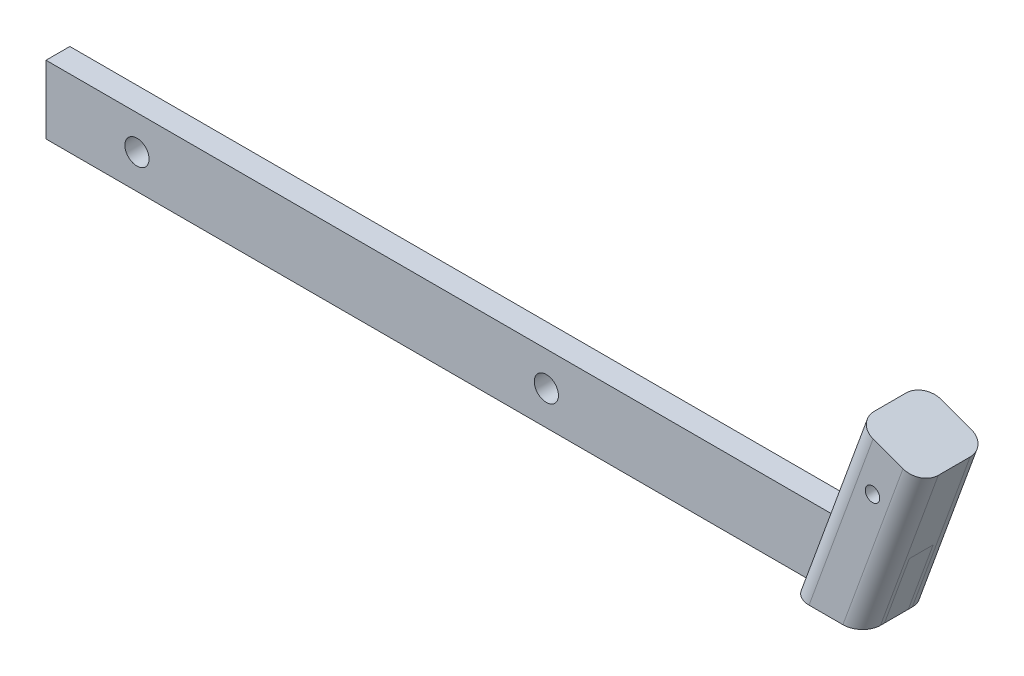
ISO-10303-21;
HEADER;
FILE_DESCRIPTION(('STEP AP214'),'2;1');
FILE_NAME('part.step','',(''),(''),'','','');
FILE_SCHEMA(('AUTOMOTIVE_DESIGN { 1 0 10303 214 1 1 1 1 }'));
ENDSEC;
DATA;
#1=APPLICATION_CONTEXT('core data for automotive mechanical design processes');
#2=APPLICATION_PROTOCOL_DEFINITION('international standard','automotive_design',2000,#1);
#3=PRODUCT_CONTEXT('',#1,'mechanical');
#4=PRODUCT('Part','Part','',(#3));
#5=PRODUCT_RELATED_PRODUCT_CATEGORY('part','',(#4));
#6=PRODUCT_DEFINITION_FORMATION('','',#4);
#7=PRODUCT_DEFINITION_CONTEXT('part definition',#1,'design');
#8=PRODUCT_DEFINITION('design','',#6,#7);
#9=PRODUCT_DEFINITION_SHAPE('','',#8);
#10=(LENGTH_UNIT() NAMED_UNIT(*) SI_UNIT(.MILLI.,.METRE.));
#11=(NAMED_UNIT(*) PLANE_ANGLE_UNIT() SI_UNIT($,.RADIAN.));
#12=(NAMED_UNIT(*) SI_UNIT($,.STERADIAN.) SOLID_ANGLE_UNIT());
#13=UNCERTAINTY_MEASURE_WITH_UNIT(LENGTH_MEASURE(1.E-05),#10,'distance_accuracy_value','');
#14=(GEOMETRIC_REPRESENTATION_CONTEXT(3) GLOBAL_UNCERTAINTY_ASSIGNED_CONTEXT((#13)) GLOBAL_UNIT_ASSIGNED_CONTEXT((#10,
#11,#12)) REPRESENTATION_CONTEXT('',''));
#15=CARTESIAN_POINT('',(0.,0.,0.));
#16=DIRECTION('',(0.,0.,1.));
#17=DIRECTION('',(1.,0.,0.));
#18=AXIS2_PLACEMENT_3D('',#15,#16,#17);
#19=CARTESIAN_POINT('',(-0.55938940169234,-29.386146661385,-9.525));
#20=DIRECTION('',(0.939692620785907,-0.342020143325672,0.));
#21=DIRECTION('',(0.342020143325672,0.939692620785907,0.));
#22=AXIS2_PLACEMENT_3D('',#19,#20,#21);
#23=PLANE('',#22);
#24=DIRECTION('',(-0.342020143325672,-0.939692620785907,0.));
#25=VECTOR('',#24,1.);
#26=CARTESIAN_POINT('',(12.9780644997125,7.80770224963224,-3.32740000000001));
#27=LINE('',#26,#25);
#28=CARTESIAN_POINT('',(17.0699262456043,19.05,-3.32740000000001));
#29=VERTEX_POINT('',#28);
#30=CARTESIAN_POINT('',(10.1362932828331,0.,-3.32740000000001));
#31=VERTEX_POINT('',#30);
#32=EDGE_CURVE('E57',#29,#31,#27,.T.);
#33=ORIENTED_EDGE('',*,*,#32,.F.);
#34=DIRECTION('',(0.,0.,-1.));
#35=VECTOR('',#34,1.);
#36=CARTESIAN_POINT('',(17.0699262456043,19.05,-3.3274));
#37=LINE('',#36,#35);
#38=CARTESIAN_POINT('',(17.0699262456043,19.05,3.32739999999999));
#39=VERTEX_POINT('',#38);
#40=EDGE_CURVE('E80',#39,#29,#37,.T.);
#41=ORIENTED_EDGE('',*,*,#40,.F.);
#42=DIRECTION('',(0.342020143325672,0.939692620785907,0.));
#43=VECTOR('',#42,1.);
#44=CARTESIAN_POINT('',(12.9780644997125,7.80770224963224,3.3274));
#45=LINE('',#44,#43);
#46=CARTESIAN_POINT('',(10.1362932828331,0.,3.32740000000001));
#47=VERTEX_POINT('',#46);
#48=EDGE_CURVE('E85',#47,#39,#45,.T.);
#49=ORIENTED_EDGE('',*,*,#48,.F.);
#50=DIRECTION('',(0.,0.,1.));
#51=VECTOR('',#50,1.);
#52=CARTESIAN_POINT('',(10.1362932828331,0.,-3.3274));
#53=LINE('',#52,#51);
#54=EDGE_CURVE('E100',#31,#47,#53,.T.);
#55=ORIENTED_EDGE('',*,*,#54,.F.);
#56=EDGE_LOOP('',(#33,#41,#49,#55));
#57=FACE_BOUND('',#56,.T.);
#58=ADVANCED_FACE('F49',(#57),#23,.T.);
#59=CARTESIAN_POINT('',(-223.965917593072,0.,0.));
#60=DIRECTION('',(1.,0.,0.));
#61=DIRECTION('',(0.,0.,-1.));
#62=AXIS2_PLACEMENT_3D('',#59,#60,#61);
#63=PLANE('',#62);
#64=DIRECTION('',(0.,-1.,0.));
#65=VECTOR('',#64,1.);
#66=CARTESIAN_POINT('',(-223.965917593072,0.,-3.32740000000001));
#67=LINE('',#66,#65);
#68=CARTESIAN_POINT('',(-223.965917593072,19.05,-3.32740000000001));
#69=VERTEX_POINT('',#68);
#70=CARTESIAN_POINT('',(-223.965917593072,0.,-3.32740000000001));
#71=VERTEX_POINT('',#70);
#72=EDGE_CURVE('E109',#69,#71,#67,.T.);
#73=ORIENTED_EDGE('',*,*,#72,.T.);
#74=DIRECTION('',(0.,0.,1.));
#75=VECTOR('',#74,1.);
#76=CARTESIAN_POINT('',(-223.965917593072,0.,-3.32740000000001));
#77=LINE('',#76,#75);
#78=CARTESIAN_POINT('',(-223.965917593072,0.,3.32740000000001));
#79=VERTEX_POINT('',#78);
#80=EDGE_CURVE('E98',#71,#79,#77,.T.);
#81=ORIENTED_EDGE('',*,*,#80,.T.);
#82=DIRECTION('',(0.,1.,0.));
#83=VECTOR('',#82,1.);
#84=CARTESIAN_POINT('',(-223.965917593072,0.,3.32740000000001));
#85=LINE('',#84,#83);
#86=CARTESIAN_POINT('',(-223.965917593072,19.05,3.32739999999999));
#87=VERTEX_POINT('',#86);
#88=EDGE_CURVE('E101',#79,#87,#85,.T.);
#89=ORIENTED_EDGE('',*,*,#88,.T.);
#90=DIRECTION('',(0.,0.,-1.));
#91=VECTOR('',#90,1.);
#92=CARTESIAN_POINT('',(-223.965917593072,19.05,-3.32740000000001));
#93=LINE('',#92,#91);
#94=EDGE_CURVE('E106',#87,#69,#93,.T.);
#95=ORIENTED_EDGE('',*,*,#94,.T.);
#96=EDGE_LOOP('',(#73,#81,#89,#95));
#97=FACE_BOUND('',#96,.T.);
#98=ADVANCED_FACE('F108',(#97),#63,.F.);
#99=CARTESIAN_POINT('',(34.4295501284019,0.,-3.32740000000001));
#100=DIRECTION('',(0.,-1.,0.));
#101=DIRECTION('',(1.,0.,0.));
#102=AXIS2_PLACEMENT_3D('',#99,#100,#101);
#103=PLANE('',#102);
#104=DIRECTION('',(-1.,0.,0.));
#105=VECTOR('',#104,1.);
#106=CARTESIAN_POINT('',(34.4295501284019,0.,-3.32740000000001));
#107=LINE('',#106,#105);
#108=EDGE_CURVE('E12',#31,#71,#107,.T.);
#109=ORIENTED_EDGE('',*,*,#108,.F.);
#110=ORIENTED_EDGE('',*,*,#54,.T.);
#111=DIRECTION('',(-1.,0.,0.));
#112=VECTOR('',#111,1.);
#113=CARTESIAN_POINT('',(34.4295501284019,0.,3.32740000000001));
#114=LINE('',#113,#112);
#115=EDGE_CURVE('E95',#47,#79,#114,.T.);
#116=ORIENTED_EDGE('',*,*,#115,.T.);
#117=ORIENTED_EDGE('',*,*,#80,.F.);
#118=EDGE_LOOP('',(#109,#110,#116,#117));
#119=FACE_BOUND('',#118,.T.);
#120=ADVANCED_FACE('F96',(#119),#103,.T.);
#121=CARTESIAN_POINT('',(34.4295501284019,0.,3.32740000000001));
#122=DIRECTION('',(0.,0.,1.));
#123=DIRECTION('',(0.,-1.,0.));
#124=AXIS2_PLACEMENT_3D('',#121,#122,#123);
#125=PLANE('',#124);
#126=CARTESIAN_POINT('',(-198.565917593072,9.52499999999997,3.3274));
#127=DIRECTION('',(0.,0.,1.));
#128=DIRECTION('',(0.,-1.,0.));
#129=AXIS2_PLACEMENT_3D('',#126,#127,#128);
#130=CIRCLE('',#129,3.3782);
#131=CARTESIAN_POINT('',(-198.565917593072,6.14679999999997,3.3274));
#132=VERTEX_POINT('',#131);
#133=EDGE_CURVE('E131',#132,#132,#130,.T.);
#134=ORIENTED_EDGE('',*,*,#133,.F.);
#135=EDGE_LOOP('',(#134));
#136=FACE_BOUND('',#135,.T.);
#137=CARTESIAN_POINT('',(-84.2659175930719,9.52499999999995,3.3274));
#138=DIRECTION('',(0.,0.,1.));
#139=DIRECTION('',(0.,-1.,0.));
#140=AXIS2_PLACEMENT_3D('',#137,#138,#139);
#141=CIRCLE('',#140,3.3782);
#142=CARTESIAN_POINT('',(-84.2659175930719,6.14679999999996,3.3274));
#143=VERTEX_POINT('',#142);
#144=EDGE_CURVE('E111',#143,#143,#141,.T.);
#145=ORIENTED_EDGE('',*,*,#144,.F.);
#146=EDGE_LOOP('',(#145));
#147=FACE_BOUND('',#146,.T.);
#148=ORIENTED_EDGE('',*,*,#115,.F.);
#149=ORIENTED_EDGE('',*,*,#48,.T.);
#150=DIRECTION('',(-1.,0.,0.));
#151=VECTOR('',#150,1.);
#152=CARTESIAN_POINT('',(34.4295501284019,19.05,3.32739999999999));
#153=LINE('',#152,#151);
#154=EDGE_CURVE('E90',#39,#87,#153,.T.);
#155=ORIENTED_EDGE('',*,*,#154,.T.);
#156=ORIENTED_EDGE('',*,*,#88,.F.);
#157=EDGE_LOOP('',(#148,#149,#155,#156));
#158=FACE_BOUND('',#157,.T.);
#159=ADVANCED_FACE('F102',(#136,#147,#158),#125,.T.);
#160=CARTESIAN_POINT('',(34.4295501284019,19.05,-3.32740000000001));
#161=DIRECTION('',(0.,1.,0.));
#162=DIRECTION('',(-1.,0.,0.));
#163=AXIS2_PLACEMENT_3D('',#160,#161,#162);
#164=PLANE('',#163);
#165=ORIENTED_EDGE('',*,*,#154,.F.);
#166=ORIENTED_EDGE('',*,*,#40,.T.);
#167=DIRECTION('',(-1.,0.,0.));
#168=VECTOR('',#167,1.);
#169=CARTESIAN_POINT('',(34.4295501284019,19.05,-3.32740000000001));
#170=LINE('',#169,#168);
#171=EDGE_CURVE('E117',#29,#69,#170,.T.);
#172=ORIENTED_EDGE('',*,*,#171,.T.);
#173=ORIENTED_EDGE('',*,*,#94,.F.);
#174=EDGE_LOOP('',(#165,#166,#172,#173));
#175=FACE_BOUND('',#174,.T.);
#176=ADVANCED_FACE('F123',(#175),#164,.T.);
#177=CARTESIAN_POINT('',(34.4295501284019,0.,-3.32740000000001));
#178=DIRECTION('',(0.,0.,-1.));
#179=DIRECTION('',(-1.,0.,0.));
#180=AXIS2_PLACEMENT_3D('',#177,#178,#179);
#181=PLANE('',#180);
#182=CARTESIAN_POINT('',(-198.565917593072,9.52499999999997,-3.32740000000001));
#183=DIRECTION('',(0.,0.,-1.));
#184=DIRECTION('',(-1.,0.,0.));
#185=AXIS2_PLACEMENT_3D('',#182,#183,#184);
#186=CIRCLE('',#185,3.3782);
#187=CARTESIAN_POINT('',(-201.944117593072,9.52499999999997,-3.32740000000001));
#188=VERTEX_POINT('',#187);
#189=EDGE_CURVE('E134',#188,#188,#186,.T.);
#190=ORIENTED_EDGE('',*,*,#189,.F.);
#191=EDGE_LOOP('',(#190));
#192=FACE_BOUND('',#191,.T.);
#193=CARTESIAN_POINT('',(-84.2659175930719,9.52499999999995,-3.32740000000001));
#194=DIRECTION('',(0.,0.,-1.));
#195=DIRECTION('',(-1.,0.,0.));
#196=AXIS2_PLACEMENT_3D('',#193,#194,#195);
#197=CIRCLE('',#196,3.3782);
#198=CARTESIAN_POINT('',(-87.6441175930719,9.52499999999995,-3.32740000000001));
#199=VERTEX_POINT('',#198);
#200=EDGE_CURVE('E128',#199,#199,#197,.T.);
#201=ORIENTED_EDGE('',*,*,#200,.F.);
#202=EDGE_LOOP('',(#201));
#203=FACE_BOUND('',#202,.T.);
#204=ORIENTED_EDGE('',*,*,#171,.F.);
#205=ORIENTED_EDGE('',*,*,#32,.T.);
#206=ORIENTED_EDGE('',*,*,#108,.T.);
#207=ORIENTED_EDGE('',*,*,#72,.F.);
#208=EDGE_LOOP('',(#204,#205,#206,#207));
#209=FACE_BOUND('',#208,.T.);
#210=ADVANCED_FACE('F124',(#192,#203,#209),#181,.T.);
#211=CARTESIAN_POINT('',(-84.2659175930719,9.52499999999995,-3.32740000000001));
#212=DIRECTION('',(0.,0.,-1.));
#213=DIRECTION('',(-1.,0.,0.));
#214=AXIS2_PLACEMENT_3D('',#211,#212,#213);
#215=CYLINDRICAL_SURFACE('',#214,3.3782);
#216=ORIENTED_EDGE('',*,*,#144,.T.);
#217=EDGE_LOOP('',(#216));
#218=FACE_BOUND('',#217,.T.);
#219=ORIENTED_EDGE('',*,*,#200,.T.);
#220=EDGE_LOOP('',(#219));
#221=FACE_BOUND('',#220,.T.);
#222=ADVANCED_FACE('F142',(#218,#221),#215,.F.);
#223=CARTESIAN_POINT('',(-198.565917593072,9.52499999999997,-3.32740000000001));
#224=DIRECTION('',(0.,0.,-1.));
#225=DIRECTION('',(-1.,0.,0.));
#226=AXIS2_PLACEMENT_3D('',#223,#224,#225);
#227=CYLINDRICAL_SURFACE('',#226,3.3782);
#228=ORIENTED_EDGE('',*,*,#133,.T.);
#229=EDGE_LOOP('',(#228));
#230=FACE_BOUND('',#229,.T.);
#231=ORIENTED_EDGE('',*,*,#189,.T.);
#232=EDGE_LOOP('',(#231));
#233=FACE_BOUND('',#232,.T.);
#234=ADVANCED_FACE('F138',(#230,#233),#227,.F.);
#235=CLOSED_SHELL('',(#58,#98,#120,#159,#176,#210,#222,#234));
#236=MANIFOLD_SOLID_BREP('B2',#235);
#237=CARTESIAN_POINT('',(0.,0.,0.));
#238=DIRECTION('',(0.,1.,0.));
#239=DIRECTION('',(0.,0.,1.));
#240=AXIS2_PLACEMENT_3D('',#237,#238,#239);
#241=PLANE('',#240);
#242=DIRECTION('',(0.,0.,1.));
#243=VECTOR('',#242,1.);
#244=CARTESIAN_POINT('',(10.1362932828331,0.,-9.52500000000001));
#245=LINE('',#244,#243);
#246=CARTESIAN_POINT('',(10.1362932828331,0.,3.32740000000001));
#247=VERTEX_POINT('',#246);
#248=CARTESIAN_POINT('',(10.1362932828331,0.,4.445));
#249=VERTEX_POINT('',#248);
#250=EDGE_CURVE('E318',#247,#249,#245,.T.);
#251=ORIENTED_EDGE('',*,*,#250,.T.);
#252=CARTESIAN_POINT('',(4.73027019865544,0.,4.445));
#253=DIRECTION('',(0.,1.,0.));
#254=DIRECTION('',(1.,0.,0.));
#255=AXIS2_PLACEMENT_3D('',#252,#253,#254);
#256=ELLIPSE('',#255,5.40602308417764,5.08);
#257=CARTESIAN_POINT('',(4.73027019865544,0.,9.525));
#258=VERTEX_POINT('',#257);
#259=EDGE_CURVE('E371',#249,#258,#256,.F.);
#260=ORIENTED_EDGE('',*,*,#259,.T.);
#261=DIRECTION('',(-1.,0.,0.));
#262=VECTOR('',#261,1.);
#263=CARTESIAN_POINT('',(-0.55938940169234,0.,9.525));
#264=LINE('',#263,#262);
#265=CARTESIAN_POINT('',(-4.73027019865544,0.,9.525));
#266=VERTEX_POINT('',#265);
#267=EDGE_CURVE('E341',#258,#266,#264,.T.);
#268=ORIENTED_EDGE('',*,*,#267,.T.);
#269=CARTESIAN_POINT('',(-4.73027019865544,0.,4.445));
#270=DIRECTION('',(0.,1.,0.));
#271=DIRECTION('',(1.,0.,0.));
#272=AXIS2_PLACEMENT_3D('',#269,#270,#271);
#273=ELLIPSE('',#272,5.40602308417764,5.08);
#274=CARTESIAN_POINT('',(-10.1362932828331,0.,4.445));
#275=VERTEX_POINT('',#274);
#276=EDGE_CURVE('E369',#266,#275,#273,.F.);
#277=ORIENTED_EDGE('',*,*,#276,.T.);
#278=DIRECTION('',(0.,0.,-1.));
#279=VECTOR('',#278,1.);
#280=CARTESIAN_POINT('',(-10.1362932828331,0.,-9.525));
#281=LINE('',#280,#279);
#282=CARTESIAN_POINT('',(-10.1362932828331,0.,3.32740000000001));
#283=VERTEX_POINT('',#282);
#284=EDGE_CURVE('E321',#275,#283,#281,.T.);
#285=ORIENTED_EDGE('',*,*,#284,.T.);
#286=DIRECTION('',(-1.,0.,0.));
#287=VECTOR('',#286,1.);
#288=CARTESIAN_POINT('',(34.4295501284019,0.,3.32740000000001));
#289=LINE('',#288,#287);
#290=EDGE_CURVE('E308',#247,#283,#289,.T.);
#291=ORIENTED_EDGE('',*,*,#290,.F.);
#292=EDGE_LOOP('',(#251,#260,#268,#277,#285,#291));
#293=FACE_BOUND('',#292,.T.);
#294=ADVANCED_FACE('F215',(#293),#241,.F.);
#295=CARTESIAN_POINT('',(-18.4605338276639,-22.8706629310309,-9.525));
#296=DIRECTION('',(-0.939692620785907,0.342020143325673,0.));
#297=DIRECTION('',(-0.342020143325673,-0.939692620785907,0.));
#298=AXIS2_PLACEMENT_3D('',#295,#296,#297);
#299=PLANE('',#298);
#300=ORIENTED_EDGE('',*,*,#284,.F.);
#301=DIRECTION('',(0.342020143325673,0.939692620785907,0.));
#302=VECTOR('',#301,1.);
#303=CARTESIAN_POINT('',(-18.4605338276639,-22.8706629310309,4.445));
#304=LINE('',#303,#302);
#305=CARTESIAN_POINT('',(8.38351019394234,50.882741865177,4.445));
#306=VERTEX_POINT('',#305);
#307=EDGE_CURVE('E375',#275,#306,#304,.T.);
#308=ORIENTED_EDGE('',*,*,#307,.T.);
#309=DIRECTION('',(0.,0.,1.));
#310=VECTOR('',#309,1.);
#311=CARTESIAN_POINT('',(8.38351019394233,50.882741865177,-9.525));
#312=LINE('',#311,#310);
#313=CARTESIAN_POINT('',(8.38351019394234,50.882741865177,-4.445));
#314=VERTEX_POINT('',#313);
#315=EDGE_CURVE('E342',#314,#306,#312,.T.);
#316=ORIENTED_EDGE('',*,*,#315,.F.);
#317=DIRECTION('',(0.342020143325673,0.939692620785907,0.));
#318=VECTOR('',#317,1.);
#319=CARTESIAN_POINT('',(-18.4605338276639,-22.8706629310309,-4.445));
#320=LINE('',#319,#318);
#321=CARTESIAN_POINT('',(-10.1362932828331,0.,-4.445));
#322=VERTEX_POINT('',#321);
#323=EDGE_CURVE('E373',#314,#322,#320,.F.);
#324=ORIENTED_EDGE('',*,*,#323,.T.);
#325=CARTESIAN_POINT('',(-10.1362932828331,0.,-3.32740000000001));
#326=VERTEX_POINT('',#325);
#327=EDGE_CURVE('E339',#326,#322,#281,.T.);
#328=ORIENTED_EDGE('',*,*,#327,.F.);
#329=DIRECTION('',(-0.342020143325673,-0.939692620785907,0.));
#330=VECTOR('',#329,1.);
#331=CARTESIAN_POINT('',(-18.4605338276639,-22.8706629310309,-3.32740000000001));
#332=LINE('',#331,#330);
#333=CARTESIAN_POINT('',(-3.20266032006183,19.05,-3.32740000000001));
#334=VERTEX_POINT('',#333);
#335=EDGE_CURVE('E533',#334,#326,#332,.T.);
#336=ORIENTED_EDGE('',*,*,#335,.F.);
#337=DIRECTION('',(0.,0.,-1.));
#338=VECTOR('',#337,1.);
#339=CARTESIAN_POINT('',(-3.20266032006185,19.05,-9.525));
#340=LINE('',#339,#338);
#341=CARTESIAN_POINT('',(-3.20266032006184,19.05,3.32739999999999));
#342=VERTEX_POINT('',#341);
#343=EDGE_CURVE('E526',#342,#334,#340,.T.);
#344=ORIENTED_EDGE('',*,*,#343,.F.);
#345=DIRECTION('',(0.342020143325673,0.939692620785907,0.));
#346=VECTOR('',#345,1.);
#347=CARTESIAN_POINT('',(-18.4605338276639,-22.8706629310309,3.32740000000003));
#348=LINE('',#347,#346);
#349=EDGE_CURVE('E531',#283,#342,#348,.T.);
#350=ORIENTED_EDGE('',*,*,#349,.F.);
#351=EDGE_LOOP('',(#300,#308,#316,#324,#328,#336,#344,#350));
#352=FACE_BOUND('',#351,.T.);
#353=ADVANCED_FACE('F399',(#352),#299,.T.);
#354=CARTESIAN_POINT('',(-0.559389401692346,-29.386146661385,-9.525));
#355=DIRECTION('',(0.,0.,-1.));
#356=DIRECTION('',(-1.,0.,0.));
#357=AXIS2_PLACEMENT_3D('',#354,#355,#356);
#358=PLANE('',#357);
#359=CARTESIAN_POINT('',(12.9904265866921,35.690903716019,-9.525));
#360=DIRECTION('',(0.,0.,-1.));
#361=DIRECTION('',(0.,1.,0.));
#362=AXIS2_PLACEMENT_3D('',#359,#360,#361);
#363=CIRCLE('',#362,2.01929999999999);
#364=CARTESIAN_POINT('',(12.9904265866921,37.710203716019,-9.525));
#365=VERTEX_POINT('',#364);
#366=EDGE_CURVE('E530',#365,#365,#363,.T.);
#367=ORIENTED_EDGE('',*,*,#366,.F.);
#368=EDGE_LOOP('',(#367));
#369=FACE_BOUND('',#368,.T.);
#370=DIRECTION('',(1.,0.,0.));
#371=VECTOR('',#370,1.);
#372=CARTESIAN_POINT('',(-0.559389401692346,0.,-9.525));
#373=LINE('',#372,#371);
#374=CARTESIAN_POINT('',(-4.73027019865544,0.,-9.525));
#375=VERTEX_POINT('',#374);
#376=CARTESIAN_POINT('',(4.73027019865543,0.,-9.525));
#377=VERTEX_POINT('',#376);
#378=EDGE_CURVE('E330',#375,#377,#373,.T.);
#379=ORIENTED_EDGE('',*,*,#378,.F.);
#380=DIRECTION('',(0.342020143325673,0.939692620785907,0.));
#381=VECTOR('',#380,1.);
#382=CARTESIAN_POINT('',(-13.6868953140715,-24.6081252591254,-9.525));
#383=LINE('',#382,#381);
#384=CARTESIAN_POINT('',(13.1571487075347,49.1452795370826,-9.525));
#385=VERTEX_POINT('',#384);
#386=EDGE_CURVE('E379',#375,#385,#383,.T.);
#387=ORIENTED_EDGE('',*,*,#386,.T.);
#388=DIRECTION('',(-0.939692620785907,0.342020143325673,0.));
#389=VECTOR('',#388,1.);
#390=CARTESIAN_POINT('',(26.2846546199139,44.367258134823,-9.525));
#391=LINE('',#390,#389);
#392=CARTESIAN_POINT('',(21.5110161063215,46.1047204629174,-9.525));
#393=VERTEX_POINT('',#392);
#394=EDGE_CURVE('E328',#393,#385,#391,.T.);
#395=ORIENTED_EDGE('',*,*,#394,.F.);
#396=DIRECTION('',(0.342020143325672,0.939692620785907,0.));
#397=VECTOR('',#396,1.);
#398=CARTESIAN_POINT('',(-5.33302791528475,-27.6486843332906,-9.525));
#399=LINE('',#398,#397);
#400=EDGE_CURVE('E230',#393,#377,#399,.F.);
#401=ORIENTED_EDGE('',*,*,#400,.T.);
#402=EDGE_LOOP('',(#379,#387,#395,#401));
#403=FACE_BOUND('',#402,.T.);
#404=ADVANCED_FACE('F392',(#369,#403),#358,.T.);
#405=CARTESIAN_POINT('',(-0.559389401692346,-29.386146661385,-9.525));
#406=DIRECTION('',(0.939692620785907,-0.342020143325672,0.));
#407=DIRECTION('',(0.342020143325672,0.939692620785907,0.));
#408=AXIS2_PLACEMENT_3D('',#405,#406,#407);
#409=PLANE('',#408);
#410=DIRECTION('',(0.,0.,-1.));
#411=VECTOR('',#410,1.);
#412=CARTESIAN_POINT('',(26.2846546199139,44.367258134823,-9.525));
#413=LINE('',#412,#411);
#414=CARTESIAN_POINT('',(26.2846546199139,44.367258134823,4.445));
#415=VERTEX_POINT('',#414);
#416=CARTESIAN_POINT('',(26.2846546199139,44.367258134823,-4.445));
#417=VERTEX_POINT('',#416);
#418=EDGE_CURVE('E332',#415,#417,#413,.T.);
#419=ORIENTED_EDGE('',*,*,#418,.F.);
#420=DIRECTION('',(0.342020143325672,0.939692620785907,0.));
#421=VECTOR('',#420,1.);
#422=CARTESIAN_POINT('',(-0.559389401692341,-29.386146661385,4.445));
#423=LINE('',#422,#421);
#424=EDGE_CURVE('E326',#415,#249,#423,.F.);
#425=ORIENTED_EDGE('',*,*,#424,.T.);
#426=ORIENTED_EDGE('',*,*,#250,.F.);
#427=DIRECTION('',(0.342020143325672,0.939692620785907,0.));
#428=VECTOR('',#427,1.);
#429=CARTESIAN_POINT('',(12.9780644997125,7.80770224963225,3.3274));
#430=LINE('',#429,#428);
#431=CARTESIAN_POINT('',(17.0699262456043,19.05,3.32739999999999));
#432=VERTEX_POINT('',#431);
#433=EDGE_CURVE('E305',#247,#432,#430,.T.);
#434=ORIENTED_EDGE('',*,*,#433,.T.);
#435=DIRECTION('',(0.,0.,-1.));
#436=VECTOR('',#435,1.);
#437=CARTESIAN_POINT('',(17.0699262456043,19.05,-3.3274));
#438=LINE('',#437,#436);
#439=CARTESIAN_POINT('',(17.0699262456043,19.05,-3.32740000000001));
#440=VERTEX_POINT('',#439);
#441=EDGE_CURVE('E534',#432,#440,#438,.T.);
#442=ORIENTED_EDGE('',*,*,#441,.T.);
#443=DIRECTION('',(-0.342020143325672,-0.939692620785907,0.));
#444=VECTOR('',#443,1.);
#445=CARTESIAN_POINT('',(12.9780644997125,7.80770224963225,-3.32740000000001));
#446=LINE('',#445,#444);
#447=CARTESIAN_POINT('',(10.1362932828331,0.,-3.32740000000001));
#448=VERTEX_POINT('',#447);
#449=EDGE_CURVE('E389',#440,#448,#446,.T.);
#450=ORIENTED_EDGE('',*,*,#449,.T.);
#451=CARTESIAN_POINT('',(10.1362932828331,0.,-4.445));
#452=VERTEX_POINT('',#451);
#453=EDGE_CURVE('E327',#452,#448,#245,.T.);
#454=ORIENTED_EDGE('',*,*,#453,.F.);
#455=DIRECTION('',(0.342020143325672,0.939692620785907,0.));
#456=VECTOR('',#455,1.);
#457=CARTESIAN_POINT('',(-0.559389401692345,-29.386146661385,-4.445));
#458=LINE('',#457,#456);
#459=EDGE_CURVE('E365',#452,#417,#458,.T.);
#460=ORIENTED_EDGE('',*,*,#459,.T.);
#461=EDGE_LOOP('',(#419,#425,#426,#434,#442,#450,#454,#460));
#462=FACE_BOUND('',#461,.T.);
#463=ADVANCED_FACE('F324',(#462),#409,.T.);
#464=CARTESIAN_POINT('',(-0.55938940169234,-29.386146661385,9.525));
#465=DIRECTION('',(0.,0.,1.));
#466=DIRECTION('',(1.,0.,0.));
#467=AXIS2_PLACEMENT_3D('',#464,#465,#466);
#468=PLANE('',#467);
#469=CARTESIAN_POINT('',(12.9904265866921,35.690903716019,9.52500000000001));
#470=DIRECTION('',(0.,0.,-1.));
#471=DIRECTION('',(0.,1.,0.));
#472=AXIS2_PLACEMENT_3D('',#469,#470,#471);
#473=CIRCLE('',#472,2.01929999999999);
#474=CARTESIAN_POINT('',(12.9904265866921,37.710203716019,9.52500000000001));
#475=VERTEX_POINT('',#474);
#476=EDGE_CURVE('E336',#475,#475,#473,.T.);
#477=ORIENTED_EDGE('',*,*,#476,.T.);
#478=EDGE_LOOP('',(#477));
#479=FACE_BOUND('',#478,.T.);
#480=ORIENTED_EDGE('',*,*,#267,.F.);
#481=DIRECTION('',(0.342020143325672,0.939692620785907,0.));
#482=VECTOR('',#481,1.);
#483=CARTESIAN_POINT('',(-5.33302791528474,-27.6486843332906,9.525));
#484=LINE('',#483,#482);
#485=CARTESIAN_POINT('',(21.5110161063215,46.1047204629174,9.525));
#486=VERTEX_POINT('',#485);
#487=EDGE_CURVE('E354',#258,#486,#484,.T.);
#488=ORIENTED_EDGE('',*,*,#487,.T.);
#489=DIRECTION('',(0.939692620785907,-0.342020143325672,0.));
#490=VECTOR('',#489,1.);
#491=CARTESIAN_POINT('',(26.2846546199139,44.367258134823,9.525));
#492=LINE('',#491,#490);
#493=CARTESIAN_POINT('',(13.1571487075347,49.1452795370826,9.525));
#494=VERTEX_POINT('',#493);
#495=EDGE_CURVE('E345',#494,#486,#492,.T.);
#496=ORIENTED_EDGE('',*,*,#495,.F.);
#497=DIRECTION('',(0.342020143325673,0.939692620785907,0.));
#498=VECTOR('',#497,1.);
#499=CARTESIAN_POINT('',(-13.6868953140715,-24.6081252591254,9.525));
#500=LINE('',#499,#498);
#501=EDGE_CURVE('E352',#494,#266,#500,.F.);
#502=ORIENTED_EDGE('',*,*,#501,.T.);
#503=EDGE_LOOP('',(#480,#488,#496,#502));
#504=FACE_BOUND('',#503,.T.);
#505=ADVANCED_FACE('F409',(#479,#504),#468,.T.);
#506=CARTESIAN_POINT('',(17.3340824069281,47.625,0.));
#507=DIRECTION('',(-0.342020143325672,-0.939692620785907,0.));
#508=DIRECTION('',(0.939692620785907,-0.342020143325672,0.));
#509=AXIS2_PLACEMENT_3D('',#506,#507,#508);
#510=PLANE('',#509);
#511=ORIENTED_EDGE('',*,*,#495,.T.);
#512=CARTESIAN_POINT('',(21.5110161063215,46.1047204629174,4.445));
#513=DIRECTION('',(-0.342020143325672,-0.939692620785907,0.));
#514=DIRECTION('',(0.939692620785907,-0.342020143325672,0.));
#515=AXIS2_PLACEMENT_3D('',#512,#513,#514);
#516=CIRCLE('',#515,5.08);
#517=EDGE_CURVE('E363',#486,#415,#516,.F.);
#518=ORIENTED_EDGE('',*,*,#517,.T.);
#519=ORIENTED_EDGE('',*,*,#418,.T.);
#520=CARTESIAN_POINT('',(21.5110161063215,46.1047204629174,-4.445));
#521=DIRECTION('',(-0.342020143325672,-0.939692620785907,0.));
#522=DIRECTION('',(0.939692620785907,-0.342020143325672,0.));
#523=AXIS2_PLACEMENT_3D('',#520,#521,#522);
#524=CIRCLE('',#523,5.08);
#525=EDGE_CURVE('E357',#417,#393,#524,.F.);
#526=ORIENTED_EDGE('',*,*,#525,.T.);
#527=ORIENTED_EDGE('',*,*,#394,.T.);
#528=CARTESIAN_POINT('',(13.1571487075347,49.1452795370826,-4.445));
#529=DIRECTION('',(-0.342020143325672,-0.939692620785907,0.));
#530=DIRECTION('',(0.939692620785907,-0.342020143325672,0.));
#531=AXIS2_PLACEMENT_3D('',#528,#529,#530);
#532=CIRCLE('',#531,5.08);
#533=EDGE_CURVE('E359',#385,#314,#532,.F.);
#534=ORIENTED_EDGE('',*,*,#533,.T.);
#535=ORIENTED_EDGE('',*,*,#315,.T.);
#536=CARTESIAN_POINT('',(13.1571487075347,49.1452795370826,4.445));
#537=DIRECTION('',(-0.342020143325672,-0.939692620785907,0.));
#538=DIRECTION('',(0.939692620785907,-0.342020143325672,0.));
#539=AXIS2_PLACEMENT_3D('',#536,#537,#538);
#540=CIRCLE('',#539,5.08);
#541=EDGE_CURVE('E361',#306,#494,#540,.F.);
#542=ORIENTED_EDGE('',*,*,#541,.T.);
#543=EDGE_LOOP('',(#511,#518,#519,#526,#527,#534,#535,#542));
#544=FACE_BOUND('',#543,.T.);
#545=ADVANCED_FACE('F391',(#544),#510,.F.);
#546=ORIENTED_EDGE('',*,*,#327,.T.);
#547=CARTESIAN_POINT('',(-4.73027019865544,0.,-4.445));
#548=DIRECTION('',(0.,1.,0.));
#549=DIRECTION('',(1.,0.,0.));
#550=AXIS2_PLACEMENT_3D('',#547,#548,#549);
#551=ELLIPSE('',#550,5.40602308417764,5.08);
#552=EDGE_CURVE('E47',#322,#375,#551,.F.);
#553=ORIENTED_EDGE('',*,*,#552,.T.);
#554=ORIENTED_EDGE('',*,*,#378,.T.);
#555=CARTESIAN_POINT('',(4.73027019865543,0.,-4.445));
#556=DIRECTION('',(0.,1.,0.));
#557=DIRECTION('',(1.,0.,0.));
#558=AXIS2_PLACEMENT_3D('',#555,#556,#557);
#559=ELLIPSE('',#558,5.40602308417764,5.08);
#560=EDGE_CURVE('E223',#377,#452,#559,.F.);
#561=ORIENTED_EDGE('',*,*,#560,.T.);
#562=ORIENTED_EDGE('',*,*,#453,.T.);
#563=DIRECTION('',(-1.,0.,0.));
#564=VECTOR('',#563,1.);
#565=CARTESIAN_POINT('',(34.4295501284019,0.,-3.32740000000001));
#566=LINE('',#565,#564);
#567=EDGE_CURVE('E536',#448,#326,#566,.T.);
#568=ORIENTED_EDGE('',*,*,#567,.T.);
#569=EDGE_LOOP('',(#546,#553,#554,#561,#562,#568));
#570=FACE_BOUND('',#569,.T.);
#571=ADVANCED_FACE('F383',(#570),#241,.F.);
#572=CARTESIAN_POINT('',(12.9904265866921,35.690903716019,-9.525));
#573=DIRECTION('',(0.,0.,-1.));
#574=DIRECTION('',(0.,1.,0.));
#575=AXIS2_PLACEMENT_3D('',#572,#573,#574);
#576=CYLINDRICAL_SURFACE('',#575,2.01929999999999);
#577=ORIENTED_EDGE('',*,*,#476,.F.);
#578=EDGE_LOOP('',(#577));
#579=FACE_BOUND('',#578,.T.);
#580=ORIENTED_EDGE('',*,*,#366,.T.);
#581=EDGE_LOOP('',(#580));
#582=FACE_BOUND('',#581,.T.);
#583=ADVANCED_FACE('F433',(#579,#582),#576,.F.);
#584=CARTESIAN_POINT('',(34.4295501284019,0.,3.32740000000001));
#585=DIRECTION('',(0.,0.,1.));
#586=DIRECTION('',(0.,-1.,0.));
#587=AXIS2_PLACEMENT_3D('',#584,#585,#586);
#588=PLANE('',#587);
#589=ORIENTED_EDGE('',*,*,#349,.T.);
#590=DIRECTION('',(-1.,0.,0.));
#591=VECTOR('',#590,1.);
#592=CARTESIAN_POINT('',(34.4295501284019,19.05,3.32739999999999));
#593=LINE('',#592,#591);
#594=EDGE_CURVE('E311',#432,#342,#593,.T.);
#595=ORIENTED_EDGE('',*,*,#594,.F.);
#596=ORIENTED_EDGE('',*,*,#433,.F.);
#597=ORIENTED_EDGE('',*,*,#290,.T.);
#598=EDGE_LOOP('',(#589,#595,#596,#597));
#599=FACE_BOUND('',#598,.T.);
#600=ADVANCED_FACE('F307',(#599),#588,.F.);
#601=CARTESIAN_POINT('',(34.4295501284019,19.05,-3.32740000000001));
#602=DIRECTION('',(0.,1.,0.));
#603=DIRECTION('',(-1.,0.,0.));
#604=AXIS2_PLACEMENT_3D('',#601,#602,#603);
#605=PLANE('',#604);
#606=ORIENTED_EDGE('',*,*,#343,.T.);
#607=DIRECTION('',(-1.,0.,0.));
#608=VECTOR('',#607,1.);
#609=CARTESIAN_POINT('',(34.4295501284019,19.05,-3.32740000000001));
#610=LINE('',#609,#608);
#611=EDGE_CURVE('E528',#440,#334,#610,.T.);
#612=ORIENTED_EDGE('',*,*,#611,.F.);
#613=ORIENTED_EDGE('',*,*,#441,.F.);
#614=ORIENTED_EDGE('',*,*,#594,.T.);
#615=EDGE_LOOP('',(#606,#612,#613,#614));
#616=FACE_BOUND('',#615,.T.);
#617=ADVANCED_FACE('F421',(#616),#605,.F.);
#618=CARTESIAN_POINT('',(34.4295501284019,0.,-3.32740000000001));
#619=DIRECTION('',(0.,0.,-1.));
#620=DIRECTION('',(-1.,0.,0.));
#621=AXIS2_PLACEMENT_3D('',#618,#619,#620);
#622=PLANE('',#621);
#623=ORIENTED_EDGE('',*,*,#335,.T.);
#624=ORIENTED_EDGE('',*,*,#567,.F.);
#625=ORIENTED_EDGE('',*,*,#449,.F.);
#626=ORIENTED_EDGE('',*,*,#611,.T.);
#627=EDGE_LOOP('',(#623,#624,#625,#626));
#628=FACE_BOUND('',#627,.T.);
#629=ADVANCED_FACE('F414',(#628),#622,.F.);
#630=CARTESIAN_POINT('',(-5.33302791528475,-27.6486843332906,4.445));
#631=DIRECTION('',(0.342020143325672,0.939692620785907,0.));
#632=DIRECTION('',(-0.939692620785907,0.342020143325672,0.));
#633=AXIS2_PLACEMENT_3D('',#630,#631,#632);
#634=CYLINDRICAL_SURFACE('',#633,5.08);
#635=ORIENTED_EDGE('',*,*,#259,.F.);
#636=ORIENTED_EDGE('',*,*,#424,.F.);
#637=ORIENTED_EDGE('',*,*,#517,.F.);
#638=ORIENTED_EDGE('',*,*,#487,.F.);
#639=EDGE_LOOP('',(#635,#636,#637,#638));
#640=FACE_BOUND('',#639,.T.);
#641=ADVANCED_FACE('F412',(#640),#634,.T.);
#642=CARTESIAN_POINT('',(-13.6868953140715,-24.6081252591254,4.445));
#643=DIRECTION('',(0.342020143325673,0.939692620785907,0.));
#644=DIRECTION('',(-0.939692620785907,0.342020143325673,0.));
#645=AXIS2_PLACEMENT_3D('',#642,#643,#644);
#646=CYLINDRICAL_SURFACE('',#645,5.08);
#647=ORIENTED_EDGE('',*,*,#276,.F.);
#648=ORIENTED_EDGE('',*,*,#501,.F.);
#649=ORIENTED_EDGE('',*,*,#541,.F.);
#650=ORIENTED_EDGE('',*,*,#307,.F.);
#651=EDGE_LOOP('',(#647,#648,#649,#650));
#652=FACE_BOUND('',#651,.T.);
#653=ADVANCED_FACE('F404',(#652),#646,.T.);
#654=CARTESIAN_POINT('',(-13.6868953140715,-24.6081252591254,-4.445));
#655=DIRECTION('',(0.342020143325673,0.939692620785907,0.));
#656=DIRECTION('',(-0.939692620785907,0.342020143325673,0.));
#657=AXIS2_PLACEMENT_3D('',#654,#655,#656);
#658=CYLINDRICAL_SURFACE('',#657,5.08);
#659=ORIENTED_EDGE('',*,*,#552,.F.);
#660=ORIENTED_EDGE('',*,*,#323,.F.);
#661=ORIENTED_EDGE('',*,*,#533,.F.);
#662=ORIENTED_EDGE('',*,*,#386,.F.);
#663=EDGE_LOOP('',(#659,#660,#661,#662));
#664=FACE_BOUND('',#663,.T.);
#665=ADVANCED_FACE('F395',(#664),#658,.T.);
#666=CARTESIAN_POINT('',(-5.33302791528475,-27.6486843332906,-4.445));
#667=DIRECTION('',(0.342020143325672,0.939692620785907,0.));
#668=DIRECTION('',(-0.939692620785907,0.342020143325672,0.));
#669=AXIS2_PLACEMENT_3D('',#666,#667,#668);
#670=CYLINDRICAL_SURFACE('',#669,5.08);
#671=ORIENTED_EDGE('',*,*,#560,.F.);
#672=ORIENTED_EDGE('',*,*,#400,.F.);
#673=ORIENTED_EDGE('',*,*,#525,.F.);
#674=ORIENTED_EDGE('',*,*,#459,.F.);
#675=EDGE_LOOP('',(#671,#672,#673,#674));
#676=FACE_BOUND('',#675,.T.);
#677=ADVANCED_FACE('F217',(#676),#670,.T.);
#678=CLOSED_SHELL('',(#294,#353,#404,#463,#505,#545,#571,#583,#600,#617,#629,#641,#653,#665,#677));
#679=MANIFOLD_SOLID_BREP('B6',#678);
#680=ADVANCED_BREP_SHAPE_REPRESENTATION('',(#18,#236,#679),#14);
#681=SHAPE_DEFINITION_REPRESENTATION(#9,#680);
ENDSEC;
END-ISO-10303-21;
